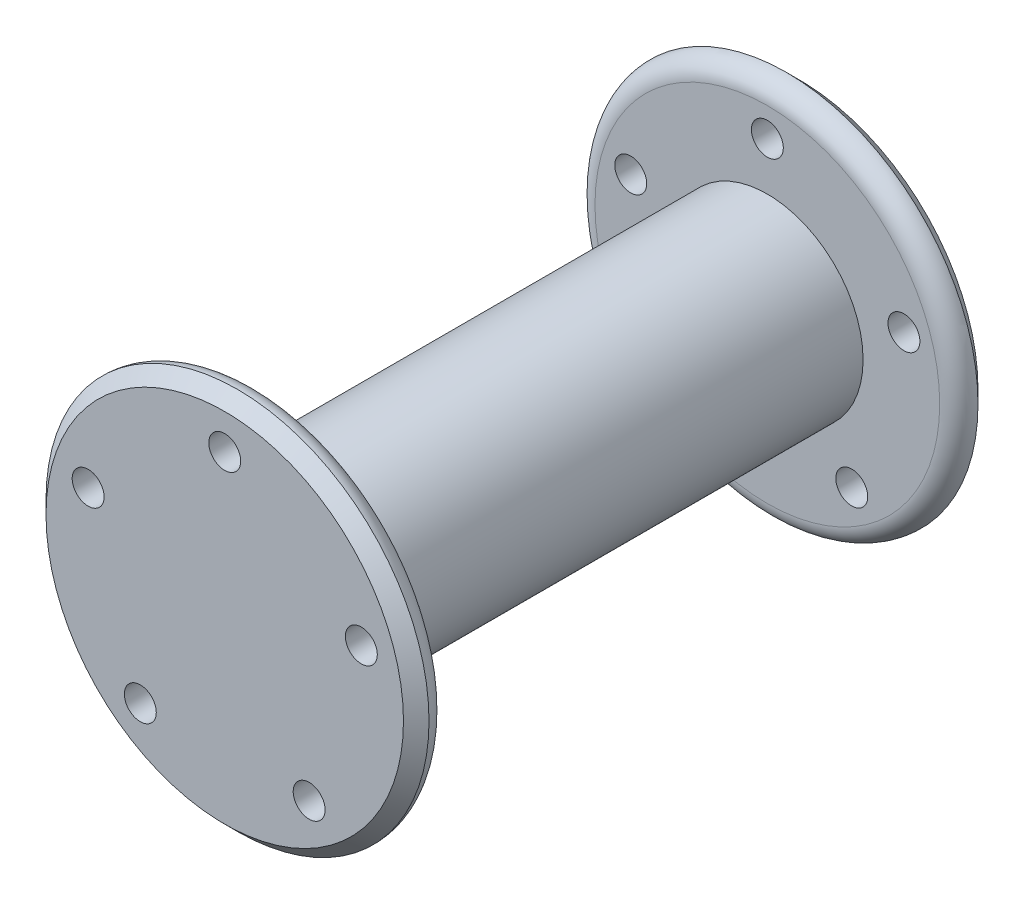
ISO-10303-21;
HEADER;
FILE_DESCRIPTION(('STEP AP214'),'2;1');
FILE_NAME('part.step','',(''),(''),'','','');
FILE_SCHEMA(('AUTOMOTIVE_DESIGN { 1 0 10303 214 1 1 1 1 }'));
ENDSEC;
DATA;
#1=APPLICATION_CONTEXT('core data for automotive mechanical design processes');
#2=APPLICATION_PROTOCOL_DEFINITION('international standard','automotive_design',2000,#1);
#3=PRODUCT_CONTEXT('',#1,'mechanical');
#4=PRODUCT('Part','Part','',(#3));
#5=PRODUCT_RELATED_PRODUCT_CATEGORY('part','',(#4));
#6=PRODUCT_DEFINITION_FORMATION('','',#4);
#7=PRODUCT_DEFINITION_CONTEXT('part definition',#1,'design');
#8=PRODUCT_DEFINITION('design','',#6,#7);
#9=PRODUCT_DEFINITION_SHAPE('','',#8);
#10=(LENGTH_UNIT() NAMED_UNIT(*) SI_UNIT(.MILLI.,.METRE.));
#11=(NAMED_UNIT(*) PLANE_ANGLE_UNIT() SI_UNIT($,.RADIAN.));
#12=(NAMED_UNIT(*) SI_UNIT($,.STERADIAN.) SOLID_ANGLE_UNIT());
#13=UNCERTAINTY_MEASURE_WITH_UNIT(LENGTH_MEASURE(1.E-05),#10,'distance_accuracy_value','');
#14=(GEOMETRIC_REPRESENTATION_CONTEXT(3) GLOBAL_UNCERTAINTY_ASSIGNED_CONTEXT((#13)) GLOBAL_UNIT_ASSIGNED_CONTEXT((#10,
#11,#12)) REPRESENTATION_CONTEXT('',''));
#15=CARTESIAN_POINT('',(0.,0.,0.));
#16=DIRECTION('',(0.,0.,1.));
#17=DIRECTION('',(1.,0.,0.));
#18=AXIS2_PLACEMENT_3D('',#15,#16,#17);
#19=CARTESIAN_POINT('',(0.,0.,40.));
#20=DIRECTION('',(0.,0.,-1.));
#21=DIRECTION('',(-1.,0.,0.));
#22=AXIS2_PLACEMENT_3D('',#19,#20,#21);
#23=CYLINDRICAL_SURFACE('',#22,15.);
#24=CARTESIAN_POINT('',(0.,0.,40.));
#25=DIRECTION('',(0.,0.,1.));
#26=DIRECTION('',(1.,0.,0.));
#27=AXIS2_PLACEMENT_3D('',#24,#25,#26);
#28=CIRCLE('',#27,15.);
#29=CARTESIAN_POINT('',(15.,0.,40.));
#30=VERTEX_POINT('',#29);
#31=EDGE_CURVE('E113',#30,#30,#28,.T.);
#32=ORIENTED_EDGE('',*,*,#31,.F.);
#33=EDGE_LOOP('',(#32));
#34=FACE_BOUND('',#33,.T.);
#35=CARTESIAN_POINT('',(0.,0.,-40.));
#36=DIRECTION('',(0.,0.,1.));
#37=DIRECTION('',(1.,0.,0.));
#38=AXIS2_PLACEMENT_3D('',#35,#36,#37);
#39=CIRCLE('',#38,15.);
#40=CARTESIAN_POINT('',(15.,0.,-40.));
#41=VERTEX_POINT('',#40);
#42=EDGE_CURVE('E118',#41,#41,#39,.T.);
#43=ORIENTED_EDGE('',*,*,#42,.T.);
#44=EDGE_LOOP('',(#43));
#45=FACE_BOUND('',#44,.T.);
#46=ADVANCED_FACE('F36',(#34,#45),#23,.T.);
#47=CARTESIAN_POINT('',(0.,0.,-45.));
#48=DIRECTION('',(0.,0.,-1.));
#49=DIRECTION('',(-1.,0.,0.));
#50=AXIS2_PLACEMENT_3D('',#47,#48,#49);
#51=PLANE('',#50);
#52=CARTESIAN_POINT('',(-21.398771616641,6.95288237343626,-45.));
#53=DIRECTION('',(0.,0.,-1.));
#54=DIRECTION('',(-0.309016994374945,-0.951056516295155,0.));
#55=AXIS2_PLACEMENT_3D('',#52,#53,#54);
#56=CIRCLE('',#55,2.5);
#57=CARTESIAN_POINT('',(-22.1713141025783,4.57524108269837,-45.));
#58=VERTEX_POINT('',#57);
#59=EDGE_CURVE('E91',#58,#58,#56,.T.);
#60=ORIENTED_EDGE('',*,*,#59,.F.);
#61=EDGE_LOOP('',(#60));
#62=FACE_BOUND('',#61,.T.);
#63=CARTESIAN_POINT('',(-13.2251681765805,-18.2028823734364,-45.));
#64=DIRECTION('',(0.,0.,-1.));
#65=DIRECTION('',(0.809016994374951,-0.587785252292469,0.));
#66=AXIS2_PLACEMENT_3D('',#63,#64,#65);
#67=CIRCLE('',#66,2.5);
#68=CARTESIAN_POINT('',(-11.2026256906432,-19.6723455041676,-45.));
#69=VERTEX_POINT('',#68);
#70=EDGE_CURVE('E96',#69,#69,#67,.T.);
#71=ORIENTED_EDGE('',*,*,#70,.F.);
#72=EDGE_LOOP('',(#71));
#73=FACE_BOUND('',#72,.T.);
#74=CARTESIAN_POINT('',(13.2251681765808,-18.2028823734362,-45.));
#75=DIRECTION('',(0.,0.,-1.));
#76=DIRECTION('',(0.809016994374942,0.58778525229248,0.));
#77=AXIS2_PLACEMENT_3D('',#74,#75,#76);
#78=CIRCLE('',#77,2.5);
#79=CARTESIAN_POINT('',(15.2477106625182,-16.733419242705,-45.));
#80=VERTEX_POINT('',#79);
#81=EDGE_CURVE('E100',#80,#80,#78,.T.);
#82=ORIENTED_EDGE('',*,*,#81,.F.);
#83=EDGE_LOOP('',(#82));
#84=FACE_BOUND('',#83,.T.);
#85=CARTESIAN_POINT('',(21.3987716166409,6.95288237343656,-45.));
#86=DIRECTION('',(0.,0.,-1.));
#87=DIRECTION('',(-0.309016994374958,0.95105651629515,0.));
#88=AXIS2_PLACEMENT_3D('',#85,#86,#87);
#89=CIRCLE('',#88,2.5);
#90=CARTESIAN_POINT('',(20.6262291307035,9.33052366417444,-45.));
#91=VERTEX_POINT('',#90);
#92=EDGE_CURVE('E63',#91,#91,#89,.T.);
#93=ORIENTED_EDGE('',*,*,#92,.F.);
#94=EDGE_LOOP('',(#93));
#95=FACE_BOUND('',#94,.T.);
#96=CARTESIAN_POINT('',(0.,22.5,-45.));
#97=DIRECTION('',(0.,0.,-1.));
#98=DIRECTION('',(-1.,0.,0.));
#99=AXIS2_PLACEMENT_3D('',#96,#97,#98);
#100=CIRCLE('',#99,2.5);
#101=CARTESIAN_POINT('',(-2.5,22.5,-45.));
#102=VERTEX_POINT('',#101);
#103=EDGE_CURVE('E107',#102,#102,#100,.T.);
#104=ORIENTED_EDGE('',*,*,#103,.F.);
#105=EDGE_LOOP('',(#104));
#106=FACE_BOUND('',#105,.T.);
#107=CARTESIAN_POINT('',(0.,0.,-45.));
#108=DIRECTION('',(0.,0.,-1.));
#109=DIRECTION('',(-1.,0.,0.));
#110=AXIS2_PLACEMENT_3D('',#107,#108,#109);
#111=CIRCLE('',#110,28.);
#112=CARTESIAN_POINT('',(-28.,0.,-45.));
#113=VERTEX_POINT('',#112);
#114=EDGE_CURVE('E117',#113,#113,#111,.T.);
#115=ORIENTED_EDGE('',*,*,#114,.T.);
#116=EDGE_LOOP('',(#115));
#117=FACE_BOUND('',#116,.T.);
#118=ADVANCED_FACE('F167',(#62,#73,#84,#95,#106,#117),#51,.T.);
#119=CARTESIAN_POINT('',(0.,0.,-40.));
#120=DIRECTION('',(0.,0.,-1.));
#121=DIRECTION('',(-1.,0.,0.));
#122=AXIS2_PLACEMENT_3D('',#119,#120,#121);
#123=PLANE('',#122);
#124=CARTESIAN_POINT('',(0.,0.,-40.));
#125=DIRECTION('',(0.,0.,-1.));
#126=DIRECTION('',(-1.,0.,0.));
#127=AXIS2_PLACEMENT_3D('',#124,#125,#126);
#128=CIRCLE('',#127,27.);
#129=CARTESIAN_POINT('',(-27.,0.,-40.));
#130=VERTEX_POINT('',#129);
#131=EDGE_CURVE('E55',#130,#130,#128,.F.);
#132=ORIENTED_EDGE('',*,*,#131,.T.);
#133=EDGE_LOOP('',(#132));
#134=FACE_BOUND('',#133,.T.);
#135=CARTESIAN_POINT('',(-21.398771616641,6.95288237343626,-40.));
#136=DIRECTION('',(0.,0.,-1.));
#137=DIRECTION('',(-1.,0.,0.));
#138=AXIS2_PLACEMENT_3D('',#135,#136,#137);
#139=CIRCLE('',#138,2.5);
#140=CARTESIAN_POINT('',(-23.898771616641,6.95288237343626,-40.));
#141=VERTEX_POINT('',#140);
#142=EDGE_CURVE('E112',#141,#141,#139,.T.);
#143=ORIENTED_EDGE('',*,*,#142,.T.);
#144=EDGE_LOOP('',(#143));
#145=FACE_BOUND('',#144,.T.);
#146=CARTESIAN_POINT('',(-13.2251681765805,-18.2028823734364,-40.));
#147=DIRECTION('',(0.,0.,-1.));
#148=DIRECTION('',(-1.,0.,0.));
#149=AXIS2_PLACEMENT_3D('',#146,#147,#148);
#150=CIRCLE('',#149,2.5);
#151=CARTESIAN_POINT('',(-15.7251681765805,-18.2028823734364,-40.));
#152=VERTEX_POINT('',#151);
#153=EDGE_CURVE('E139',#152,#152,#150,.T.);
#154=ORIENTED_EDGE('',*,*,#153,.T.);
#155=EDGE_LOOP('',(#154));
#156=FACE_BOUND('',#155,.T.);
#157=CARTESIAN_POINT('',(13.2251681765808,-18.2028823734362,-40.));
#158=DIRECTION('',(0.,0.,-1.));
#159=DIRECTION('',(-1.,0.,0.));
#160=AXIS2_PLACEMENT_3D('',#157,#158,#159);
#161=CIRCLE('',#160,2.5);
#162=CARTESIAN_POINT('',(10.7251681765808,-18.2028823734362,-40.));
#163=VERTEX_POINT('',#162);
#164=EDGE_CURVE('E135',#163,#163,#161,.T.);
#165=ORIENTED_EDGE('',*,*,#164,.T.);
#166=EDGE_LOOP('',(#165));
#167=FACE_BOUND('',#166,.T.);
#168=CARTESIAN_POINT('',(21.3987716166409,6.95288237343656,-40.));
#169=DIRECTION('',(0.,0.,-1.));
#170=DIRECTION('',(-1.,0.,0.));
#171=AXIS2_PLACEMENT_3D('',#168,#169,#170);
#172=CIRCLE('',#171,2.5);
#173=CARTESIAN_POINT('',(18.8987716166409,6.95288237343656,-40.));
#174=VERTEX_POINT('',#173);
#175=EDGE_CURVE('E95',#174,#174,#172,.T.);
#176=ORIENTED_EDGE('',*,*,#175,.T.);
#177=EDGE_LOOP('',(#176));
#178=FACE_BOUND('',#177,.T.);
#179=CARTESIAN_POINT('',(0.,22.5,-40.));
#180=DIRECTION('',(0.,0.,-1.));
#181=DIRECTION('',(-1.,0.,0.));
#182=AXIS2_PLACEMENT_3D('',#179,#180,#181);
#183=CIRCLE('',#182,2.5);
#184=CARTESIAN_POINT('',(-2.5,22.5,-40.));
#185=VERTEX_POINT('',#184);
#186=EDGE_CURVE('E111',#185,#185,#183,.T.);
#187=ORIENTED_EDGE('',*,*,#186,.T.);
#188=EDGE_LOOP('',(#187));
#189=FACE_BOUND('',#188,.T.);
#190=ORIENTED_EDGE('',*,*,#42,.F.);
#191=EDGE_LOOP('',(#190));
#192=FACE_BOUND('',#191,.T.);
#193=ADVANCED_FACE('F149',(#134,#145,#156,#167,#178,#189,#192),#123,.F.);
#194=CARTESIAN_POINT('',(0.,0.,-45.));
#195=DIRECTION('',(0.,0.,1.));
#196=DIRECTION('',(1.,0.,0.));
#197=AXIS2_PLACEMENT_3D('',#194,#195,#196);
#198=CONICAL_SURFACE('',#197,28.,0.785398163397447);
#199=CARTESIAN_POINT('',(0.,0.,-43.));
#200=DIRECTION('',(0.,0.,-1.));
#201=DIRECTION('',(-1.,0.,0.));
#202=AXIS2_PLACEMENT_3D('',#199,#200,#201);
#203=CIRCLE('',#202,30.);
#204=CARTESIAN_POINT('',(-30.,0.,-43.));
#205=VERTEX_POINT('',#204);
#206=EDGE_CURVE('E125',#205,#205,#203,.F.);
#207=ORIENTED_EDGE('',*,*,#206,.F.);
#208=EDGE_LOOP('',(#207));
#209=FACE_BOUND('',#208,.T.);
#210=ORIENTED_EDGE('',*,*,#114,.F.);
#211=EDGE_LOOP('',(#210));
#212=FACE_BOUND('',#211,.T.);
#213=ADVANCED_FACE('F160',(#209,#212),#198,.T.);
#214=CARTESIAN_POINT('',(0.,22.5,40.));
#215=DIRECTION('',(0.,0.,-1.));
#216=DIRECTION('',(-1.,0.,0.));
#217=AXIS2_PLACEMENT_3D('',#214,#215,#216);
#218=CYLINDRICAL_SURFACE('',#217,2.5);
#219=ORIENTED_EDGE('',*,*,#103,.T.);
#220=EDGE_LOOP('',(#219));
#221=FACE_BOUND('',#220,.T.);
#222=ORIENTED_EDGE('',*,*,#186,.F.);
#223=EDGE_LOOP('',(#222));
#224=FACE_BOUND('',#223,.T.);
#225=ADVANCED_FACE('F163',(#221,#224),#218,.F.);
#226=CARTESIAN_POINT('',(21.3987716166409,6.95288237343656,40.));
#227=DIRECTION('',(0.,0.,-1.));
#228=DIRECTION('',(-1.,0.,0.));
#229=AXIS2_PLACEMENT_3D('',#226,#227,#228);
#230=CYLINDRICAL_SURFACE('',#229,2.5);
#231=ORIENTED_EDGE('',*,*,#92,.T.);
#232=EDGE_LOOP('',(#231));
#233=FACE_BOUND('',#232,.T.);
#234=ORIENTED_EDGE('',*,*,#175,.F.);
#235=EDGE_LOOP('',(#234));
#236=FACE_BOUND('',#235,.T.);
#237=ADVANCED_FACE('F233',(#233,#236),#230,.F.);
#238=CARTESIAN_POINT('',(13.2251681765808,-18.2028823734362,40.));
#239=DIRECTION('',(0.,0.,-1.));
#240=DIRECTION('',(-1.,0.,0.));
#241=AXIS2_PLACEMENT_3D('',#238,#239,#240);
#242=CYLINDRICAL_SURFACE('',#241,2.5);
#243=ORIENTED_EDGE('',*,*,#81,.T.);
#244=EDGE_LOOP('',(#243));
#245=FACE_BOUND('',#244,.T.);
#246=ORIENTED_EDGE('',*,*,#164,.F.);
#247=EDGE_LOOP('',(#246));
#248=FACE_BOUND('',#247,.T.);
#249=ADVANCED_FACE('F230',(#245,#248),#242,.F.);
#250=CARTESIAN_POINT('',(-13.2251681765805,-18.2028823734364,40.));
#251=DIRECTION('',(0.,0.,-1.));
#252=DIRECTION('',(-1.,0.,0.));
#253=AXIS2_PLACEMENT_3D('',#250,#251,#252);
#254=CYLINDRICAL_SURFACE('',#253,2.5);
#255=ORIENTED_EDGE('',*,*,#70,.T.);
#256=EDGE_LOOP('',(#255));
#257=FACE_BOUND('',#256,.T.);
#258=ORIENTED_EDGE('',*,*,#153,.F.);
#259=EDGE_LOOP('',(#258));
#260=FACE_BOUND('',#259,.T.);
#261=ADVANCED_FACE('F226',(#257,#260),#254,.F.);
#262=CARTESIAN_POINT('',(-21.398771616641,6.95288237343626,40.));
#263=DIRECTION('',(0.,0.,-1.));
#264=DIRECTION('',(-1.,0.,0.));
#265=AXIS2_PLACEMENT_3D('',#262,#263,#264);
#266=CYLINDRICAL_SURFACE('',#265,2.5);
#267=ORIENTED_EDGE('',*,*,#59,.T.);
#268=EDGE_LOOP('',(#267));
#269=FACE_BOUND('',#268,.T.);
#270=ORIENTED_EDGE('',*,*,#142,.F.);
#271=EDGE_LOOP('',(#270));
#272=FACE_BOUND('',#271,.T.);
#273=ADVANCED_FACE('F156',(#269,#272),#266,.F.);
#274=CARTESIAN_POINT('',(0.,0.,-43.));
#275=DIRECTION('',(0.,0.,-1.));
#276=DIRECTION('',(-1.,0.,0.));
#277=AXIS2_PLACEMENT_3D('',#274,#275,#276);
#278=TOROIDAL_SURFACE('',#277,27.,3.);
#279=ORIENTED_EDGE('',*,*,#131,.F.);
#280=EDGE_LOOP('',(#279));
#281=FACE_BOUND('',#280,.T.);
#282=ORIENTED_EDGE('',*,*,#206,.T.);
#283=EDGE_LOOP('',(#282));
#284=FACE_BOUND('',#283,.T.);
#285=ADVANCED_FACE('F152',(#281,#284),#278,.T.);
#286=CARTESIAN_POINT('',(0.,0.,45.));
#287=DIRECTION('',(0.,0.,1.));
#288=DIRECTION('',(-1.,0.,0.));
#289=AXIS2_PLACEMENT_3D('',#286,#287,#288);
#290=PLANE('',#289);
#291=CARTESIAN_POINT('',(-21.398771616641,6.95288237343626,45.));
#292=DIRECTION('',(0.,0.,-1.));
#293=DIRECTION('',(-0.309016994374945,-0.951056516295155,0.));
#294=AXIS2_PLACEMENT_3D('',#291,#292,#293);
#295=CIRCLE('',#294,2.5);
#296=CARTESIAN_POINT('',(-18.898771616641,6.95288237343626,45.));
#297=VERTEX_POINT('',#296);
#298=EDGE_CURVE('E70',#297,#297,#295,.T.);
#299=ORIENTED_EDGE('',*,*,#298,.T.);
#300=EDGE_LOOP('',(#299));
#301=FACE_BOUND('',#300,.T.);
#302=CARTESIAN_POINT('',(-13.2251681765805,-18.2028823734364,45.));
#303=DIRECTION('',(0.,0.,-1.));
#304=DIRECTION('',(0.809016994374951,-0.587785252292469,0.));
#305=AXIS2_PLACEMENT_3D('',#302,#303,#304);
#306=CIRCLE('',#305,2.5);
#307=CARTESIAN_POINT('',(-10.7251681765805,-18.2028823734364,45.));
#308=VERTEX_POINT('',#307);
#309=EDGE_CURVE('E374',#308,#308,#306,.T.);
#310=ORIENTED_EDGE('',*,*,#309,.T.);
#311=EDGE_LOOP('',(#310));
#312=FACE_BOUND('',#311,.T.);
#313=CARTESIAN_POINT('',(13.2251681765808,-18.2028823734362,45.));
#314=DIRECTION('',(0.,0.,-1.));
#315=DIRECTION('',(0.809016994374942,0.58778525229248,0.));
#316=AXIS2_PLACEMENT_3D('',#313,#314,#315);
#317=CIRCLE('',#316,2.5);
#318=CARTESIAN_POINT('',(15.7251681765808,-18.2028823734362,45.));
#319=VERTEX_POINT('',#318);
#320=EDGE_CURVE('E378',#319,#319,#317,.T.);
#321=ORIENTED_EDGE('',*,*,#320,.T.);
#322=EDGE_LOOP('',(#321));
#323=FACE_BOUND('',#322,.T.);
#324=CARTESIAN_POINT('',(21.3987716166409,6.95288237343656,45.));
#325=DIRECTION('',(0.,0.,-1.));
#326=DIRECTION('',(-0.309016994374958,0.95105651629515,0.));
#327=AXIS2_PLACEMENT_3D('',#324,#325,#326);
#328=CIRCLE('',#327,2.5);
#329=CARTESIAN_POINT('',(23.8987716166409,6.95288237343656,45.));
#330=VERTEX_POINT('',#329);
#331=EDGE_CURVE('E89',#330,#330,#328,.T.);
#332=ORIENTED_EDGE('',*,*,#331,.T.);
#333=EDGE_LOOP('',(#332));
#334=FACE_BOUND('',#333,.T.);
#335=CARTESIAN_POINT('',(0.,22.5,45.));
#336=DIRECTION('',(0.,0.,-1.));
#337=DIRECTION('',(-1.,0.,0.));
#338=AXIS2_PLACEMENT_3D('',#335,#336,#337);
#339=CIRCLE('',#338,2.5);
#340=CARTESIAN_POINT('',(2.5,22.5,45.));
#341=VERTEX_POINT('',#340);
#342=EDGE_CURVE('E64',#341,#341,#339,.T.);
#343=ORIENTED_EDGE('',*,*,#342,.T.);
#344=EDGE_LOOP('',(#343));
#345=FACE_BOUND('',#344,.T.);
#346=CARTESIAN_POINT('',(0.,0.,45.));
#347=DIRECTION('',(0.,0.,1.));
#348=DIRECTION('',(1.,0.,0.));
#349=AXIS2_PLACEMENT_3D('',#346,#347,#348);
#350=CIRCLE('',#349,28.);
#351=CARTESIAN_POINT('',(28.,0.,45.));
#352=VERTEX_POINT('',#351);
#353=EDGE_CURVE('E44',#352,#352,#350,.T.);
#354=ORIENTED_EDGE('',*,*,#353,.T.);
#355=EDGE_LOOP('',(#354));
#356=FACE_BOUND('',#355,.T.);
#357=ADVANCED_FACE('F155',(#301,#312,#323,#334,#345,#356),#290,.T.);
#358=CARTESIAN_POINT('',(0.,0.,40.));
#359=DIRECTION('',(0.,0.,1.));
#360=DIRECTION('',(-1.,0.,0.));
#361=AXIS2_PLACEMENT_3D('',#358,#359,#360);
#362=PLANE('',#361);
#363=CARTESIAN_POINT('',(0.,0.,40.));
#364=DIRECTION('',(0.,0.,1.));
#365=DIRECTION('',(1.,0.,0.));
#366=AXIS2_PLACEMENT_3D('',#363,#364,#365);
#367=CIRCLE('',#366,27.);
#368=CARTESIAN_POINT('',(27.,0.,40.));
#369=VERTEX_POINT('',#368);
#370=EDGE_CURVE('E10',#369,#369,#367,.F.);
#371=ORIENTED_EDGE('',*,*,#370,.T.);
#372=EDGE_LOOP('',(#371));
#373=FACE_BOUND('',#372,.T.);
#374=CARTESIAN_POINT('',(-21.398771616641,6.95288237343626,40.));
#375=DIRECTION('',(0.,0.,1.));
#376=DIRECTION('',(1.,0.,0.));
#377=AXIS2_PLACEMENT_3D('',#374,#375,#376);
#378=CIRCLE('',#377,2.5);
#379=CARTESIAN_POINT('',(-18.898771616641,6.95288237343626,40.));
#380=VERTEX_POINT('',#379);
#381=EDGE_CURVE('E77',#380,#380,#378,.F.);
#382=ORIENTED_EDGE('',*,*,#381,.F.);
#383=EDGE_LOOP('',(#382));
#384=FACE_BOUND('',#383,.T.);
#385=CARTESIAN_POINT('',(-13.2251681765805,-18.2028823734364,40.));
#386=DIRECTION('',(0.,0.,1.));
#387=DIRECTION('',(1.,0.,0.));
#388=AXIS2_PLACEMENT_3D('',#385,#386,#387);
#389=CIRCLE('',#388,2.5);
#390=CARTESIAN_POINT('',(-10.7251681765805,-18.2028823734364,40.));
#391=VERTEX_POINT('',#390);
#392=EDGE_CURVE('E74',#391,#391,#389,.F.);
#393=ORIENTED_EDGE('',*,*,#392,.F.);
#394=EDGE_LOOP('',(#393));
#395=FACE_BOUND('',#394,.T.);
#396=CARTESIAN_POINT('',(13.2251681765808,-18.2028823734362,40.));
#397=DIRECTION('',(0.,0.,1.));
#398=DIRECTION('',(1.,0.,0.));
#399=AXIS2_PLACEMENT_3D('',#396,#397,#398);
#400=CIRCLE('',#399,2.5);
#401=CARTESIAN_POINT('',(15.7251681765808,-18.2028823734362,40.));
#402=VERTEX_POINT('',#401);
#403=EDGE_CURVE('E69',#402,#402,#400,.F.);
#404=ORIENTED_EDGE('',*,*,#403,.F.);
#405=EDGE_LOOP('',(#404));
#406=FACE_BOUND('',#405,.T.);
#407=CARTESIAN_POINT('',(21.3987716166409,6.95288237343656,40.));
#408=DIRECTION('',(0.,0.,1.));
#409=DIRECTION('',(1.,0.,0.));
#410=AXIS2_PLACEMENT_3D('',#407,#408,#409);
#411=CIRCLE('',#410,2.5);
#412=CARTESIAN_POINT('',(23.8987716166409,6.95288237343656,40.));
#413=VERTEX_POINT('',#412);
#414=EDGE_CURVE('E65',#413,#413,#411,.F.);
#415=ORIENTED_EDGE('',*,*,#414,.F.);
#416=EDGE_LOOP('',(#415));
#417=FACE_BOUND('',#416,.T.);
#418=CARTESIAN_POINT('',(0.,22.5,40.));
#419=DIRECTION('',(0.,0.,1.));
#420=DIRECTION('',(1.,0.,0.));
#421=AXIS2_PLACEMENT_3D('',#418,#419,#420);
#422=CIRCLE('',#421,2.5);
#423=CARTESIAN_POINT('',(2.5,22.5,40.));
#424=VERTEX_POINT('',#423);
#425=EDGE_CURVE('E59',#424,#424,#422,.F.);
#426=ORIENTED_EDGE('',*,*,#425,.F.);
#427=EDGE_LOOP('',(#426));
#428=FACE_BOUND('',#427,.T.);
#429=ORIENTED_EDGE('',*,*,#31,.T.);
#430=EDGE_LOOP('',(#429));
#431=FACE_BOUND('',#430,.T.);
#432=ADVANCED_FACE('F185',(#373,#384,#395,#406,#417,#428,#431),#362,.F.);
#433=CARTESIAN_POINT('',(0.,0.,43.));
#434=DIRECTION('',(0.,0.,-1.));
#435=DIRECTION('',(-1.,0.,0.));
#436=AXIS2_PLACEMENT_3D('',#433,#434,#435);
#437=CONICAL_SURFACE('',#436,30.,0.785398163397443);
#438=ORIENTED_EDGE('',*,*,#353,.F.);
#439=EDGE_LOOP('',(#438));
#440=FACE_BOUND('',#439,.T.);
#441=CARTESIAN_POINT('',(0.,0.,43.));
#442=DIRECTION('',(0.,0.,1.));
#443=DIRECTION('',(1.,0.,0.));
#444=AXIS2_PLACEMENT_3D('',#441,#442,#443);
#445=CIRCLE('',#444,30.);
#446=CARTESIAN_POINT('',(30.,0.,43.));
#447=VERTEX_POINT('',#446);
#448=EDGE_CURVE('E49',#447,#447,#445,.F.);
#449=ORIENTED_EDGE('',*,*,#448,.F.);
#450=EDGE_LOOP('',(#449));
#451=FACE_BOUND('',#450,.T.);
#452=ADVANCED_FACE('F182',(#440,#451),#437,.T.);
#453=CARTESIAN_POINT('',(0.,22.5,-45.));
#454=DIRECTION('',(0.,0.,1.));
#455=DIRECTION('',(1.,0.,0.));
#456=AXIS2_PLACEMENT_3D('',#453,#454,#455);
#457=CYLINDRICAL_SURFACE('',#456,2.5);
#458=CARTESIAN_POINT('',(2.5,22.5,45.));
#459=CARTESIAN_POINT('',(2.5,22.5,44.9479166666667));
#460=CARTESIAN_POINT('',(2.5,22.5,44.8958333333333));
#461=CARTESIAN_POINT('',(2.5,22.5,44.7916666666667));
#462=CARTESIAN_POINT('',(2.5,22.5,44.7395833333333));
#463=CARTESIAN_POINT('',(2.5,22.5,44.6354166666667));
#464=CARTESIAN_POINT('',(2.5,22.5,44.5833333333333));
#465=CARTESIAN_POINT('',(2.5,22.5,44.4791666666667));
#466=CARTESIAN_POINT('',(2.5,22.5,44.4270833333333));
#467=CARTESIAN_POINT('',(2.5,22.5,44.3229166666667));
#468=CARTESIAN_POINT('',(2.5,22.5,44.2708333333333));
#469=CARTESIAN_POINT('',(2.5,22.5,44.1666666666667));
#470=CARTESIAN_POINT('',(2.5,22.5,44.1145833333333));
#471=CARTESIAN_POINT('',(2.5,22.5,44.0104166666667));
#472=CARTESIAN_POINT('',(2.5,22.5,43.9583333333333));
#473=CARTESIAN_POINT('',(2.5,22.5,43.8541666666667));
#474=CARTESIAN_POINT('',(2.5,22.5,43.8020833333333));
#475=CARTESIAN_POINT('',(2.5,22.5,43.6979166666667));
#476=CARTESIAN_POINT('',(2.5,22.5,43.6458333333333));
#477=CARTESIAN_POINT('',(2.5,22.5,43.5416666666667));
#478=CARTESIAN_POINT('',(2.5,22.5,43.4895833333333));
#479=CARTESIAN_POINT('',(2.5,22.5,43.3854166666667));
#480=CARTESIAN_POINT('',(2.5,22.5,43.3333333333333));
#481=CARTESIAN_POINT('',(2.5,22.5,43.2291666666667));
#482=CARTESIAN_POINT('',(2.5,22.5,43.1770833333333));
#483=CARTESIAN_POINT('',(2.5,22.5,43.0729166666667));
#484=CARTESIAN_POINT('',(2.5,22.5,43.0208333333333));
#485=CARTESIAN_POINT('',(2.5,22.5,42.9166666666667));
#486=CARTESIAN_POINT('',(2.5,22.5,42.8645833333333));
#487=CARTESIAN_POINT('',(2.5,22.5,42.7604166666667));
#488=CARTESIAN_POINT('',(2.5,22.5,42.7083333333333));
#489=CARTESIAN_POINT('',(2.5,22.5,42.6041666666667));
#490=CARTESIAN_POINT('',(2.5,22.5,42.5520833333333));
#491=CARTESIAN_POINT('',(2.5,22.5,42.4479166666667));
#492=CARTESIAN_POINT('',(2.5,22.5,42.3958333333333));
#493=CARTESIAN_POINT('',(2.5,22.5,42.2916666666667));
#494=CARTESIAN_POINT('',(2.5,22.5,42.2395833333333));
#495=CARTESIAN_POINT('',(2.5,22.5,42.1354166666667));
#496=CARTESIAN_POINT('',(2.5,22.5,42.0833333333333));
#497=CARTESIAN_POINT('',(2.5,22.5,41.9791666666667));
#498=CARTESIAN_POINT('',(2.5,22.5,41.9270833333333));
#499=CARTESIAN_POINT('',(2.5,22.5,41.8229166666667));
#500=CARTESIAN_POINT('',(2.5,22.5,41.7708333333333));
#501=CARTESIAN_POINT('',(2.5,22.5,41.6666666666667));
#502=CARTESIAN_POINT('',(2.5,22.5,41.6145833333333));
#503=CARTESIAN_POINT('',(2.5,22.5,41.5104166666667));
#504=CARTESIAN_POINT('',(2.5,22.5,41.4583333333333));
#505=CARTESIAN_POINT('',(2.5,22.5,41.3541666666667));
#506=CARTESIAN_POINT('',(2.5,22.5,41.3020833333333));
#507=CARTESIAN_POINT('',(2.5,22.5,41.1979166666667));
#508=CARTESIAN_POINT('',(2.5,22.5,41.1458333333333));
#509=CARTESIAN_POINT('',(2.5,22.5,41.0416666666667));
#510=CARTESIAN_POINT('',(2.5,22.5,40.9895833333333));
#511=CARTESIAN_POINT('',(2.5,22.5,40.8854166666667));
#512=CARTESIAN_POINT('',(2.5,22.5,40.8333333333333));
#513=CARTESIAN_POINT('',(2.5,22.5,40.7291666666667));
#514=CARTESIAN_POINT('',(2.5,22.5,40.6770833333333));
#515=CARTESIAN_POINT('',(2.5,22.5,40.5729166666666));
#516=CARTESIAN_POINT('',(2.5,22.5,40.5208333333333));
#517=CARTESIAN_POINT('',(2.5,22.5,40.4166666666667));
#518=CARTESIAN_POINT('',(2.5,22.5,40.3645833333333));
#519=CARTESIAN_POINT('',(2.5,22.5,40.2604166666667));
#520=CARTESIAN_POINT('',(2.5,22.5,40.2083333333333));
#521=CARTESIAN_POINT('',(2.5,22.5,40.1041666666666));
#522=CARTESIAN_POINT('',(2.5,22.5,40.0520833333333));
#523=CARTESIAN_POINT('',(2.5,22.5,40.));
#524=B_SPLINE_CURVE_WITH_KNOTS('',3,(#458,#459,#460,#461,#462,#463,#464,#465,#466,#467,#468,
#469,#470,#471,#472,#473,#474,#475,#476,#477,#478,#479,#480,#481,#482,#483,#484,#485,#486,#487,
#488,#489,#490,#491,#492,#493,#494,#495,#496,#497,#498,#499,#500,#501,#502,#503,#504,#505,#506,
#507,#508,#509,#510,#511,#512,#513,#514,#515,#516,#517,#518,#519,#520,#521,#522,#523),
.UNSPECIFIED.,.F.,.F.,(4,2,2,2,2,2,2,2,2,2,2,2,2,2,2,2,2,2,2,2,2,2,2,2,2,2,2,2,2,2,2,2,4),(0.,
0.156249999999997,0.312500000000007,0.468750000000004,0.625000000000001,0.781250000000011,
0.937500000000008,1.09375,1.25,1.40625000000001,1.56250000000001,1.71875,1.87500000000002,
2.03125000000001,2.18750000000001,2.34375000000002,2.50000000000002,2.65625000000001,
2.81250000000002,2.96875000000002,3.12500000000002,3.28125000000003,3.43750000000002,
3.59375000000002,3.75000000000003,3.90625000000003,4.06250000000002,4.21875000000002,
4.37500000000003,4.53125000000003,4.68750000000002,4.84375000000004,5.00000000000003),.UNSPECIFIED.);
#525=EDGE_CURVE('BSEAM184',#341,#424,#524,.T.);
#526=ORIENTED_EDGE('',*,*,#342,.F.);
#527=ORIENTED_EDGE('',*,*,#425,.T.);
#528=ORIENTED_EDGE('',*,*,#525,.T.);
#529=ORIENTED_EDGE('',*,*,#525,.F.);
#530=EDGE_LOOP('',(#526,#528,#527,#529));
#531=FACE_BOUND('',#530,.T.);
#532=ADVANCED_FACE('F184',(#531),#457,.F.);
#533=CARTESIAN_POINT('',(21.3987716166409,6.95288237343656,-45.));
#534=DIRECTION('',(0.,0.,1.));
#535=DIRECTION('',(1.,0.,0.));
#536=AXIS2_PLACEMENT_3D('',#533,#534,#535);
#537=CYLINDRICAL_SURFACE('',#536,2.5);
#538=CARTESIAN_POINT('',(23.8987716166409,6.95288237343656,45.));
#539=CARTESIAN_POINT('',(23.8987716166409,6.95288237343656,44.9479166666667));
#540=CARTESIAN_POINT('',(23.8987716166409,6.95288237343656,44.8958333333333));
#541=CARTESIAN_POINT('',(23.8987716166409,6.95288237343656,44.7916666666667));
#542=CARTESIAN_POINT('',(23.8987716166409,6.95288237343656,44.7395833333333));
#543=CARTESIAN_POINT('',(23.8987716166409,6.95288237343656,44.6354166666667));
#544=CARTESIAN_POINT('',(23.8987716166409,6.95288237343656,44.5833333333333));
#545=CARTESIAN_POINT('',(23.8987716166409,6.95288237343656,44.4791666666667));
#546=CARTESIAN_POINT('',(23.8987716166409,6.95288237343656,44.4270833333333));
#547=CARTESIAN_POINT('',(23.8987716166409,6.95288237343656,44.3229166666667));
#548=CARTESIAN_POINT('',(23.8987716166409,6.95288237343656,44.2708333333333));
#549=CARTESIAN_POINT('',(23.8987716166409,6.95288237343656,44.1666666666667));
#550=CARTESIAN_POINT('',(23.8987716166409,6.95288237343656,44.1145833333333));
#551=CARTESIAN_POINT('',(23.8987716166409,6.95288237343656,44.0104166666667));
#552=CARTESIAN_POINT('',(23.8987716166409,6.95288237343656,43.9583333333333));
#553=CARTESIAN_POINT('',(23.8987716166409,6.95288237343656,43.8541666666667));
#554=CARTESIAN_POINT('',(23.8987716166409,6.95288237343656,43.8020833333333));
#555=CARTESIAN_POINT('',(23.8987716166409,6.95288237343656,43.6979166666667));
#556=CARTESIAN_POINT('',(23.8987716166409,6.95288237343656,43.6458333333333));
#557=CARTESIAN_POINT('',(23.8987716166409,6.95288237343656,43.5416666666667));
#558=CARTESIAN_POINT('',(23.8987716166409,6.95288237343656,43.4895833333333));
#559=CARTESIAN_POINT('',(23.8987716166409,6.95288237343656,43.3854166666667));
#560=CARTESIAN_POINT('',(23.8987716166409,6.95288237343656,43.3333333333333));
#561=CARTESIAN_POINT('',(23.8987716166409,6.95288237343656,43.2291666666667));
#562=CARTESIAN_POINT('',(23.8987716166409,6.95288237343656,43.1770833333333));
#563=CARTESIAN_POINT('',(23.8987716166409,6.95288237343656,43.0729166666667));
#564=CARTESIAN_POINT('',(23.8987716166409,6.95288237343656,43.0208333333333));
#565=CARTESIAN_POINT('',(23.8987716166409,6.95288237343656,42.9166666666667));
#566=CARTESIAN_POINT('',(23.8987716166409,6.95288237343656,42.8645833333333));
#567=CARTESIAN_POINT('',(23.8987716166409,6.95288237343656,42.7604166666667));
#568=CARTESIAN_POINT('',(23.8987716166409,6.95288237343656,42.7083333333333));
#569=CARTESIAN_POINT('',(23.8987716166409,6.95288237343656,42.6041666666667));
#570=CARTESIAN_POINT('',(23.8987716166409,6.95288237343656,42.5520833333333));
#571=CARTESIAN_POINT('',(23.8987716166409,6.95288237343656,42.4479166666667));
#572=CARTESIAN_POINT('',(23.8987716166409,6.95288237343656,42.3958333333333));
#573=CARTESIAN_POINT('',(23.8987716166409,6.95288237343656,42.2916666666667));
#574=CARTESIAN_POINT('',(23.8987716166409,6.95288237343656,42.2395833333333));
#575=CARTESIAN_POINT('',(23.8987716166409,6.95288237343656,42.1354166666667));
#576=CARTESIAN_POINT('',(23.8987716166409,6.95288237343656,42.0833333333333));
#577=CARTESIAN_POINT('',(23.8987716166409,6.95288237343656,41.9791666666667));
#578=CARTESIAN_POINT('',(23.8987716166409,6.95288237343656,41.9270833333333));
#579=CARTESIAN_POINT('',(23.8987716166409,6.95288237343656,41.8229166666667));
#580=CARTESIAN_POINT('',(23.8987716166409,6.95288237343656,41.7708333333333));
#581=CARTESIAN_POINT('',(23.8987716166409,6.95288237343656,41.6666666666667));
#582=CARTESIAN_POINT('',(23.8987716166409,6.95288237343656,41.6145833333333));
#583=CARTESIAN_POINT('',(23.8987716166409,6.95288237343656,41.5104166666667));
#584=CARTESIAN_POINT('',(23.8987716166409,6.95288237343656,41.4583333333333));
#585=CARTESIAN_POINT('',(23.8987716166409,6.95288237343656,41.3541666666667));
#586=CARTESIAN_POINT('',(23.8987716166409,6.95288237343656,41.3020833333333));
#587=CARTESIAN_POINT('',(23.8987716166409,6.95288237343656,41.1979166666667));
#588=CARTESIAN_POINT('',(23.8987716166409,6.95288237343656,41.1458333333333));
#589=CARTESIAN_POINT('',(23.8987716166409,6.95288237343656,41.0416666666667));
#590=CARTESIAN_POINT('',(23.8987716166409,6.95288237343656,40.9895833333333));
#591=CARTESIAN_POINT('',(23.8987716166409,6.95288237343656,40.8854166666667));
#592=CARTESIAN_POINT('',(23.8987716166409,6.95288237343656,40.8333333333333));
#593=CARTESIAN_POINT('',(23.8987716166409,6.95288237343656,40.7291666666667));
#594=CARTESIAN_POINT('',(23.8987716166409,6.95288237343656,40.6770833333333));
#595=CARTESIAN_POINT('',(23.8987716166409,6.95288237343656,40.5729166666666));
#596=CARTESIAN_POINT('',(23.8987716166409,6.95288237343656,40.5208333333333));
#597=CARTESIAN_POINT('',(23.8987716166409,6.95288237343656,40.4166666666667));
#598=CARTESIAN_POINT('',(23.8987716166409,6.95288237343656,40.3645833333333));
#599=CARTESIAN_POINT('',(23.8987716166409,6.95288237343656,40.2604166666667));
#600=CARTESIAN_POINT('',(23.8987716166409,6.95288237343656,40.2083333333333));
#601=CARTESIAN_POINT('',(23.8987716166409,6.95288237343656,40.1041666666666));
#602=CARTESIAN_POINT('',(23.8987716166409,6.95288237343656,40.0520833333333));
#603=CARTESIAN_POINT('',(23.8987716166409,6.95288237343656,40.));
#604=B_SPLINE_CURVE_WITH_KNOTS('',3,(#538,#539,#540,#541,#542,#543,#544,#545,#546,#547,#548,
#549,#550,#551,#552,#553,#554,#555,#556,#557,#558,#559,#560,#561,#562,#563,#564,#565,#566,#567,
#568,#569,#570,#571,#572,#573,#574,#575,#576,#577,#578,#579,#580,#581,#582,#583,#584,#585,#586,
#587,#588,#589,#590,#591,#592,#593,#594,#595,#596,#597,#598,#599,#600,#601,#602,#603),
.UNSPECIFIED.,.F.,.F.,(4,2,2,2,2,2,2,2,2,2,2,2,2,2,2,2,2,2,2,2,2,2,2,2,2,2,2,2,2,2,2,2,4),(0.,
0.156249999999997,0.312500000000007,0.468750000000004,0.625000000000001,0.781250000000011,
0.937500000000008,1.09375,1.25,1.40625000000001,1.56250000000001,1.71875,1.87500000000002,
2.03125000000001,2.18750000000001,2.34375000000002,2.50000000000002,2.65625000000001,
2.81250000000002,2.96875000000002,3.12500000000002,3.28125000000003,3.43750000000002,
3.59375000000002,3.75000000000003,3.90625000000003,4.06250000000002,4.21875000000002,
4.37500000000003,4.53125000000003,4.68750000000002,4.84375000000004,5.00000000000003),.UNSPECIFIED.);
#605=EDGE_CURVE('BSEAM191',#330,#413,#604,.T.);
#606=ORIENTED_EDGE('',*,*,#331,.F.);
#607=ORIENTED_EDGE('',*,*,#414,.T.);
#608=ORIENTED_EDGE('',*,*,#605,.T.);
#609=ORIENTED_EDGE('',*,*,#605,.F.);
#610=EDGE_LOOP('',(#606,#608,#607,#609));
#611=FACE_BOUND('',#610,.T.);
#612=ADVANCED_FACE('F191',(#611),#537,.F.);
#613=CARTESIAN_POINT('',(13.2251681765808,-18.2028823734362,-45.));
#614=DIRECTION('',(0.,0.,1.));
#615=DIRECTION('',(1.,0.,0.));
#616=AXIS2_PLACEMENT_3D('',#613,#614,#615);
#617=CYLINDRICAL_SURFACE('',#616,2.5);
#618=CARTESIAN_POINT('',(15.7251681765808,-18.2028823734362,45.));
#619=CARTESIAN_POINT('',(15.7251681765808,-18.2028823734362,44.9479166666667));
#620=CARTESIAN_POINT('',(15.7251681765808,-18.2028823734362,44.8958333333333));
#621=CARTESIAN_POINT('',(15.7251681765808,-18.2028823734362,44.7916666666667));
#622=CARTESIAN_POINT('',(15.7251681765808,-18.2028823734362,44.7395833333333));
#623=CARTESIAN_POINT('',(15.7251681765808,-18.2028823734362,44.6354166666667));
#624=CARTESIAN_POINT('',(15.7251681765808,-18.2028823734362,44.5833333333333));
#625=CARTESIAN_POINT('',(15.7251681765808,-18.2028823734362,44.4791666666667));
#626=CARTESIAN_POINT('',(15.7251681765808,-18.2028823734362,44.4270833333333));
#627=CARTESIAN_POINT('',(15.7251681765808,-18.2028823734362,44.3229166666667));
#628=CARTESIAN_POINT('',(15.7251681765808,-18.2028823734362,44.2708333333333));
#629=CARTESIAN_POINT('',(15.7251681765808,-18.2028823734362,44.1666666666667));
#630=CARTESIAN_POINT('',(15.7251681765808,-18.2028823734362,44.1145833333333));
#631=CARTESIAN_POINT('',(15.7251681765808,-18.2028823734362,44.0104166666667));
#632=CARTESIAN_POINT('',(15.7251681765808,-18.2028823734362,43.9583333333333));
#633=CARTESIAN_POINT('',(15.7251681765808,-18.2028823734362,43.8541666666667));
#634=CARTESIAN_POINT('',(15.7251681765808,-18.2028823734362,43.8020833333333));
#635=CARTESIAN_POINT('',(15.7251681765808,-18.2028823734362,43.6979166666667));
#636=CARTESIAN_POINT('',(15.7251681765808,-18.2028823734362,43.6458333333333));
#637=CARTESIAN_POINT('',(15.7251681765808,-18.2028823734362,43.5416666666667));
#638=CARTESIAN_POINT('',(15.7251681765808,-18.2028823734362,43.4895833333333));
#639=CARTESIAN_POINT('',(15.7251681765808,-18.2028823734362,43.3854166666667));
#640=CARTESIAN_POINT('',(15.7251681765808,-18.2028823734362,43.3333333333333));
#641=CARTESIAN_POINT('',(15.7251681765808,-18.2028823734362,43.2291666666667));
#642=CARTESIAN_POINT('',(15.7251681765808,-18.2028823734362,43.1770833333333));
#643=CARTESIAN_POINT('',(15.7251681765808,-18.2028823734362,43.0729166666667));
#644=CARTESIAN_POINT('',(15.7251681765808,-18.2028823734362,43.0208333333333));
#645=CARTESIAN_POINT('',(15.7251681765808,-18.2028823734362,42.9166666666667));
#646=CARTESIAN_POINT('',(15.7251681765808,-18.2028823734362,42.8645833333333));
#647=CARTESIAN_POINT('',(15.7251681765808,-18.2028823734362,42.7604166666667));
#648=CARTESIAN_POINT('',(15.7251681765808,-18.2028823734362,42.7083333333333));
#649=CARTESIAN_POINT('',(15.7251681765808,-18.2028823734362,42.6041666666667));
#650=CARTESIAN_POINT('',(15.7251681765808,-18.2028823734362,42.5520833333333));
#651=CARTESIAN_POINT('',(15.7251681765808,-18.2028823734362,42.4479166666667));
#652=CARTESIAN_POINT('',(15.7251681765808,-18.2028823734362,42.3958333333333));
#653=CARTESIAN_POINT('',(15.7251681765808,-18.2028823734362,42.2916666666667));
#654=CARTESIAN_POINT('',(15.7251681765808,-18.2028823734362,42.2395833333333));
#655=CARTESIAN_POINT('',(15.7251681765808,-18.2028823734362,42.1354166666667));
#656=CARTESIAN_POINT('',(15.7251681765808,-18.2028823734362,42.0833333333333));
#657=CARTESIAN_POINT('',(15.7251681765808,-18.2028823734362,41.9791666666667));
#658=CARTESIAN_POINT('',(15.7251681765808,-18.2028823734362,41.9270833333333));
#659=CARTESIAN_POINT('',(15.7251681765808,-18.2028823734362,41.8229166666667));
#660=CARTESIAN_POINT('',(15.7251681765808,-18.2028823734362,41.7708333333333));
#661=CARTESIAN_POINT('',(15.7251681765808,-18.2028823734362,41.6666666666667));
#662=CARTESIAN_POINT('',(15.7251681765808,-18.2028823734362,41.6145833333333));
#663=CARTESIAN_POINT('',(15.7251681765808,-18.2028823734362,41.5104166666667));
#664=CARTESIAN_POINT('',(15.7251681765808,-18.2028823734362,41.4583333333333));
#665=CARTESIAN_POINT('',(15.7251681765808,-18.2028823734362,41.3541666666667));
#666=CARTESIAN_POINT('',(15.7251681765808,-18.2028823734362,41.3020833333333));
#667=CARTESIAN_POINT('',(15.7251681765808,-18.2028823734362,41.1979166666667));
#668=CARTESIAN_POINT('',(15.7251681765808,-18.2028823734362,41.1458333333333));
#669=CARTESIAN_POINT('',(15.7251681765808,-18.2028823734362,41.0416666666667));
#670=CARTESIAN_POINT('',(15.7251681765808,-18.2028823734362,40.9895833333333));
#671=CARTESIAN_POINT('',(15.7251681765808,-18.2028823734362,40.8854166666667));
#672=CARTESIAN_POINT('',(15.7251681765808,-18.2028823734362,40.8333333333333));
#673=CARTESIAN_POINT('',(15.7251681765808,-18.2028823734362,40.7291666666667));
#674=CARTESIAN_POINT('',(15.7251681765808,-18.2028823734362,40.6770833333333));
#675=CARTESIAN_POINT('',(15.7251681765808,-18.2028823734362,40.5729166666666));
#676=CARTESIAN_POINT('',(15.7251681765808,-18.2028823734362,40.5208333333333));
#677=CARTESIAN_POINT('',(15.7251681765808,-18.2028823734362,40.4166666666667));
#678=CARTESIAN_POINT('',(15.7251681765808,-18.2028823734362,40.3645833333333));
#679=CARTESIAN_POINT('',(15.7251681765808,-18.2028823734362,40.2604166666667));
#680=CARTESIAN_POINT('',(15.7251681765808,-18.2028823734362,40.2083333333333));
#681=CARTESIAN_POINT('',(15.7251681765808,-18.2028823734362,40.1041666666666));
#682=CARTESIAN_POINT('',(15.7251681765808,-18.2028823734362,40.0520833333333));
#683=CARTESIAN_POINT('',(15.7251681765808,-18.2028823734362,40.));
#684=B_SPLINE_CURVE_WITH_KNOTS('',3,(#618,#619,#620,#621,#622,#623,#624,#625,#626,#627,#628,
#629,#630,#631,#632,#633,#634,#635,#636,#637,#638,#639,#640,#641,#642,#643,#644,#645,#646,#647,
#648,#649,#650,#651,#652,#653,#654,#655,#656,#657,#658,#659,#660,#661,#662,#663,#664,#665,#666,
#667,#668,#669,#670,#671,#672,#673,#674,#675,#676,#677,#678,#679,#680,#681,#682,#683),
.UNSPECIFIED.,.F.,.F.,(4,2,2,2,2,2,2,2,2,2,2,2,2,2,2,2,2,2,2,2,2,2,2,2,2,2,2,2,2,2,2,2,4),(0.,
0.156249999999997,0.312500000000007,0.468750000000004,0.625000000000001,0.781250000000011,
0.937500000000008,1.09375,1.25,1.40625000000001,1.56250000000001,1.71875,1.87500000000002,
2.03125000000001,2.18750000000001,2.34375000000002,2.50000000000002,2.65625000000001,
2.81250000000002,2.96875000000002,3.12500000000002,3.28125000000003,3.43750000000002,
3.59375000000002,3.75000000000003,3.90625000000003,4.06250000000002,4.21875000000002,
4.37500000000003,4.53125000000003,4.68750000000002,4.84375000000004,5.00000000000003),.UNSPECIFIED.);
#685=EDGE_CURVE('BSEAM210',#319,#402,#684,.T.);
#686=ORIENTED_EDGE('',*,*,#320,.F.);
#687=ORIENTED_EDGE('',*,*,#403,.T.);
#688=ORIENTED_EDGE('',*,*,#685,.T.);
#689=ORIENTED_EDGE('',*,*,#685,.F.);
#690=EDGE_LOOP('',(#686,#688,#687,#689));
#691=FACE_BOUND('',#690,.T.);
#692=ADVANCED_FACE('F210',(#691),#617,.F.);
#693=CARTESIAN_POINT('',(-13.2251681765805,-18.2028823734364,-45.));
#694=DIRECTION('',(0.,0.,1.));
#695=DIRECTION('',(1.,0.,0.));
#696=AXIS2_PLACEMENT_3D('',#693,#694,#695);
#697=CYLINDRICAL_SURFACE('',#696,2.5);
#698=CARTESIAN_POINT('',(-10.7251681765805,-18.2028823734364,45.));
#699=CARTESIAN_POINT('',(-10.7251681765805,-18.2028823734364,44.9479166666667));
#700=CARTESIAN_POINT('',(-10.7251681765805,-18.2028823734364,44.8958333333333));
#701=CARTESIAN_POINT('',(-10.7251681765805,-18.2028823734364,44.7916666666667));
#702=CARTESIAN_POINT('',(-10.7251681765805,-18.2028823734364,44.7395833333333));
#703=CARTESIAN_POINT('',(-10.7251681765805,-18.2028823734364,44.6354166666667));
#704=CARTESIAN_POINT('',(-10.7251681765805,-18.2028823734364,44.5833333333333));
#705=CARTESIAN_POINT('',(-10.7251681765805,-18.2028823734364,44.4791666666667));
#706=CARTESIAN_POINT('',(-10.7251681765805,-18.2028823734364,44.4270833333333));
#707=CARTESIAN_POINT('',(-10.7251681765805,-18.2028823734364,44.3229166666667));
#708=CARTESIAN_POINT('',(-10.7251681765805,-18.2028823734364,44.2708333333333));
#709=CARTESIAN_POINT('',(-10.7251681765805,-18.2028823734364,44.1666666666667));
#710=CARTESIAN_POINT('',(-10.7251681765805,-18.2028823734364,44.1145833333333));
#711=CARTESIAN_POINT('',(-10.7251681765805,-18.2028823734364,44.0104166666667));
#712=CARTESIAN_POINT('',(-10.7251681765805,-18.2028823734364,43.9583333333333));
#713=CARTESIAN_POINT('',(-10.7251681765805,-18.2028823734364,43.8541666666667));
#714=CARTESIAN_POINT('',(-10.7251681765805,-18.2028823734364,43.8020833333333));
#715=CARTESIAN_POINT('',(-10.7251681765805,-18.2028823734364,43.6979166666667));
#716=CARTESIAN_POINT('',(-10.7251681765805,-18.2028823734364,43.6458333333333));
#717=CARTESIAN_POINT('',(-10.7251681765805,-18.2028823734364,43.5416666666667));
#718=CARTESIAN_POINT('',(-10.7251681765805,-18.2028823734364,43.4895833333333));
#719=CARTESIAN_POINT('',(-10.7251681765805,-18.2028823734364,43.3854166666667));
#720=CARTESIAN_POINT('',(-10.7251681765805,-18.2028823734364,43.3333333333333));
#721=CARTESIAN_POINT('',(-10.7251681765805,-18.2028823734364,43.2291666666667));
#722=CARTESIAN_POINT('',(-10.7251681765805,-18.2028823734364,43.1770833333333));
#723=CARTESIAN_POINT('',(-10.7251681765805,-18.2028823734364,43.0729166666667));
#724=CARTESIAN_POINT('',(-10.7251681765805,-18.2028823734364,43.0208333333333));
#725=CARTESIAN_POINT('',(-10.7251681765805,-18.2028823734364,42.9166666666667));
#726=CARTESIAN_POINT('',(-10.7251681765805,-18.2028823734364,42.8645833333333));
#727=CARTESIAN_POINT('',(-10.7251681765805,-18.2028823734364,42.7604166666667));
#728=CARTESIAN_POINT('',(-10.7251681765805,-18.2028823734364,42.7083333333333));
#729=CARTESIAN_POINT('',(-10.7251681765805,-18.2028823734364,42.6041666666667));
#730=CARTESIAN_POINT('',(-10.7251681765805,-18.2028823734364,42.5520833333333));
#731=CARTESIAN_POINT('',(-10.7251681765805,-18.2028823734364,42.4479166666667));
#732=CARTESIAN_POINT('',(-10.7251681765805,-18.2028823734364,42.3958333333333));
#733=CARTESIAN_POINT('',(-10.7251681765805,-18.2028823734364,42.2916666666667));
#734=CARTESIAN_POINT('',(-10.7251681765805,-18.2028823734364,42.2395833333333));
#735=CARTESIAN_POINT('',(-10.7251681765805,-18.2028823734364,42.1354166666667));
#736=CARTESIAN_POINT('',(-10.7251681765805,-18.2028823734364,42.0833333333333));
#737=CARTESIAN_POINT('',(-10.7251681765805,-18.2028823734364,41.9791666666667));
#738=CARTESIAN_POINT('',(-10.7251681765805,-18.2028823734364,41.9270833333333));
#739=CARTESIAN_POINT('',(-10.7251681765805,-18.2028823734364,41.8229166666667));
#740=CARTESIAN_POINT('',(-10.7251681765805,-18.2028823734364,41.7708333333333));
#741=CARTESIAN_POINT('',(-10.7251681765805,-18.2028823734364,41.6666666666667));
#742=CARTESIAN_POINT('',(-10.7251681765805,-18.2028823734364,41.6145833333333));
#743=CARTESIAN_POINT('',(-10.7251681765805,-18.2028823734364,41.5104166666667));
#744=CARTESIAN_POINT('',(-10.7251681765805,-18.2028823734364,41.4583333333333));
#745=CARTESIAN_POINT('',(-10.7251681765805,-18.2028823734364,41.3541666666667));
#746=CARTESIAN_POINT('',(-10.7251681765805,-18.2028823734364,41.3020833333333));
#747=CARTESIAN_POINT('',(-10.7251681765805,-18.2028823734364,41.1979166666667));
#748=CARTESIAN_POINT('',(-10.7251681765805,-18.2028823734364,41.1458333333333));
#749=CARTESIAN_POINT('',(-10.7251681765805,-18.2028823734364,41.0416666666667));
#750=CARTESIAN_POINT('',(-10.7251681765805,-18.2028823734364,40.9895833333333));
#751=CARTESIAN_POINT('',(-10.7251681765805,-18.2028823734364,40.8854166666667));
#752=CARTESIAN_POINT('',(-10.7251681765805,-18.2028823734364,40.8333333333333));
#753=CARTESIAN_POINT('',(-10.7251681765805,-18.2028823734364,40.7291666666667));
#754=CARTESIAN_POINT('',(-10.7251681765805,-18.2028823734364,40.6770833333333));
#755=CARTESIAN_POINT('',(-10.7251681765805,-18.2028823734364,40.5729166666666));
#756=CARTESIAN_POINT('',(-10.7251681765805,-18.2028823734364,40.5208333333333));
#757=CARTESIAN_POINT('',(-10.7251681765805,-18.2028823734364,40.4166666666667));
#758=CARTESIAN_POINT('',(-10.7251681765805,-18.2028823734364,40.3645833333333));
#759=CARTESIAN_POINT('',(-10.7251681765805,-18.2028823734364,40.2604166666667));
#760=CARTESIAN_POINT('',(-10.7251681765805,-18.2028823734364,40.2083333333333));
#761=CARTESIAN_POINT('',(-10.7251681765805,-18.2028823734364,40.1041666666666));
#762=CARTESIAN_POINT('',(-10.7251681765805,-18.2028823734364,40.0520833333333));
#763=CARTESIAN_POINT('',(-10.7251681765805,-18.2028823734364,40.));
#764=B_SPLINE_CURVE_WITH_KNOTS('',3,(#698,#699,#700,#701,#702,#703,#704,#705,#706,#707,#708,
#709,#710,#711,#712,#713,#714,#715,#716,#717,#718,#719,#720,#721,#722,#723,#724,#725,#726,#727,
#728,#729,#730,#731,#732,#733,#734,#735,#736,#737,#738,#739,#740,#741,#742,#743,#744,#745,#746,
#747,#748,#749,#750,#751,#752,#753,#754,#755,#756,#757,#758,#759,#760,#761,#762,#763),
.UNSPECIFIED.,.F.,.F.,(4,2,2,2,2,2,2,2,2,2,2,2,2,2,2,2,2,2,2,2,2,2,2,2,2,2,2,2,2,2,2,2,4),(0.,
0.156249999999997,0.312500000000007,0.468750000000004,0.625000000000001,0.781250000000011,
0.937500000000008,1.09375,1.25,1.40625000000001,1.56250000000001,1.71875,1.87500000000002,
2.03125000000001,2.18750000000001,2.34375000000002,2.50000000000002,2.65625000000001,
2.81250000000002,2.96875000000002,3.12500000000002,3.28125000000003,3.43750000000002,
3.59375000000002,3.75000000000003,3.90625000000003,4.06250000000002,4.21875000000002,
4.37500000000003,4.53125000000003,4.68750000000002,4.84375000000004,5.00000000000003),.UNSPECIFIED.);
#765=EDGE_CURVE('BSEAM204',#308,#391,#764,.T.);
#766=ORIENTED_EDGE('',*,*,#309,.F.);
#767=ORIENTED_EDGE('',*,*,#392,.T.);
#768=ORIENTED_EDGE('',*,*,#765,.T.);
#769=ORIENTED_EDGE('',*,*,#765,.F.);
#770=EDGE_LOOP('',(#766,#768,#767,#769));
#771=FACE_BOUND('',#770,.T.);
#772=ADVANCED_FACE('F204',(#771),#697,.F.);
#773=CARTESIAN_POINT('',(-21.398771616641,6.95288237343626,-45.));
#774=DIRECTION('',(0.,0.,1.));
#775=DIRECTION('',(1.,0.,0.));
#776=AXIS2_PLACEMENT_3D('',#773,#774,#775);
#777=CYLINDRICAL_SURFACE('',#776,2.5);
#778=CARTESIAN_POINT('',(-18.898771616641,6.95288237343626,45.));
#779=CARTESIAN_POINT('',(-18.898771616641,6.95288237343626,44.9479166666667));
#780=CARTESIAN_POINT('',(-18.898771616641,6.95288237343626,44.8958333333333));
#781=CARTESIAN_POINT('',(-18.898771616641,6.95288237343626,44.7916666666667));
#782=CARTESIAN_POINT('',(-18.898771616641,6.95288237343626,44.7395833333333));
#783=CARTESIAN_POINT('',(-18.898771616641,6.95288237343626,44.6354166666667));
#784=CARTESIAN_POINT('',(-18.898771616641,6.95288237343626,44.5833333333333));
#785=CARTESIAN_POINT('',(-18.898771616641,6.95288237343626,44.4791666666667));
#786=CARTESIAN_POINT('',(-18.898771616641,6.95288237343626,44.4270833333333));
#787=CARTESIAN_POINT('',(-18.898771616641,6.95288237343626,44.3229166666667));
#788=CARTESIAN_POINT('',(-18.898771616641,6.95288237343626,44.2708333333333));
#789=CARTESIAN_POINT('',(-18.898771616641,6.95288237343626,44.1666666666667));
#790=CARTESIAN_POINT('',(-18.898771616641,6.95288237343626,44.1145833333333));
#791=CARTESIAN_POINT('',(-18.898771616641,6.95288237343626,44.0104166666667));
#792=CARTESIAN_POINT('',(-18.898771616641,6.95288237343626,43.9583333333333));
#793=CARTESIAN_POINT('',(-18.898771616641,6.95288237343626,43.8541666666667));
#794=CARTESIAN_POINT('',(-18.898771616641,6.95288237343626,43.8020833333333));
#795=CARTESIAN_POINT('',(-18.898771616641,6.95288237343626,43.6979166666667));
#796=CARTESIAN_POINT('',(-18.898771616641,6.95288237343626,43.6458333333333));
#797=CARTESIAN_POINT('',(-18.898771616641,6.95288237343626,43.5416666666667));
#798=CARTESIAN_POINT('',(-18.898771616641,6.95288237343626,43.4895833333333));
#799=CARTESIAN_POINT('',(-18.898771616641,6.95288237343626,43.3854166666667));
#800=CARTESIAN_POINT('',(-18.898771616641,6.95288237343626,43.3333333333333));
#801=CARTESIAN_POINT('',(-18.898771616641,6.95288237343626,43.2291666666667));
#802=CARTESIAN_POINT('',(-18.898771616641,6.95288237343626,43.1770833333333));
#803=CARTESIAN_POINT('',(-18.898771616641,6.95288237343626,43.0729166666667));
#804=CARTESIAN_POINT('',(-18.898771616641,6.95288237343626,43.0208333333333));
#805=CARTESIAN_POINT('',(-18.898771616641,6.95288237343626,42.9166666666667));
#806=CARTESIAN_POINT('',(-18.898771616641,6.95288237343626,42.8645833333333));
#807=CARTESIAN_POINT('',(-18.898771616641,6.95288237343626,42.7604166666667));
#808=CARTESIAN_POINT('',(-18.898771616641,6.95288237343626,42.7083333333333));
#809=CARTESIAN_POINT('',(-18.898771616641,6.95288237343626,42.6041666666667));
#810=CARTESIAN_POINT('',(-18.898771616641,6.95288237343626,42.5520833333333));
#811=CARTESIAN_POINT('',(-18.898771616641,6.95288237343626,42.4479166666667));
#812=CARTESIAN_POINT('',(-18.898771616641,6.95288237343626,42.3958333333333));
#813=CARTESIAN_POINT('',(-18.898771616641,6.95288237343626,42.2916666666667));
#814=CARTESIAN_POINT('',(-18.898771616641,6.95288237343626,42.2395833333333));
#815=CARTESIAN_POINT('',(-18.898771616641,6.95288237343626,42.1354166666667));
#816=CARTESIAN_POINT('',(-18.898771616641,6.95288237343626,42.0833333333333));
#817=CARTESIAN_POINT('',(-18.898771616641,6.95288237343626,41.9791666666667));
#818=CARTESIAN_POINT('',(-18.898771616641,6.95288237343626,41.9270833333333));
#819=CARTESIAN_POINT('',(-18.898771616641,6.95288237343626,41.8229166666667));
#820=CARTESIAN_POINT('',(-18.898771616641,6.95288237343626,41.7708333333333));
#821=CARTESIAN_POINT('',(-18.898771616641,6.95288237343626,41.6666666666667));
#822=CARTESIAN_POINT('',(-18.898771616641,6.95288237343626,41.6145833333333));
#823=CARTESIAN_POINT('',(-18.898771616641,6.95288237343626,41.5104166666667));
#824=CARTESIAN_POINT('',(-18.898771616641,6.95288237343626,41.4583333333333));
#825=CARTESIAN_POINT('',(-18.898771616641,6.95288237343626,41.3541666666667));
#826=CARTESIAN_POINT('',(-18.898771616641,6.95288237343626,41.3020833333333));
#827=CARTESIAN_POINT('',(-18.898771616641,6.95288237343626,41.1979166666667));
#828=CARTESIAN_POINT('',(-18.898771616641,6.95288237343626,41.1458333333333));
#829=CARTESIAN_POINT('',(-18.898771616641,6.95288237343626,41.0416666666667));
#830=CARTESIAN_POINT('',(-18.898771616641,6.95288237343626,40.9895833333333));
#831=CARTESIAN_POINT('',(-18.898771616641,6.95288237343626,40.8854166666667));
#832=CARTESIAN_POINT('',(-18.898771616641,6.95288237343626,40.8333333333333));
#833=CARTESIAN_POINT('',(-18.898771616641,6.95288237343626,40.7291666666667));
#834=CARTESIAN_POINT('',(-18.898771616641,6.95288237343626,40.6770833333333));
#835=CARTESIAN_POINT('',(-18.898771616641,6.95288237343626,40.5729166666666));
#836=CARTESIAN_POINT('',(-18.898771616641,6.95288237343626,40.5208333333333));
#837=CARTESIAN_POINT('',(-18.898771616641,6.95288237343626,40.4166666666667));
#838=CARTESIAN_POINT('',(-18.898771616641,6.95288237343626,40.3645833333333));
#839=CARTESIAN_POINT('',(-18.898771616641,6.95288237343626,40.2604166666667));
#840=CARTESIAN_POINT('',(-18.898771616641,6.95288237343626,40.2083333333333));
#841=CARTESIAN_POINT('',(-18.898771616641,6.95288237343626,40.1041666666666));
#842=CARTESIAN_POINT('',(-18.898771616641,6.95288237343626,40.0520833333333));
#843=CARTESIAN_POINT('',(-18.898771616641,6.95288237343626,40.));
#844=B_SPLINE_CURVE_WITH_KNOTS('',3,(#778,#779,#780,#781,#782,#783,#784,#785,#786,#787,#788,
#789,#790,#791,#792,#793,#794,#795,#796,#797,#798,#799,#800,#801,#802,#803,#804,#805,#806,#807,
#808,#809,#810,#811,#812,#813,#814,#815,#816,#817,#818,#819,#820,#821,#822,#823,#824,#825,#826,
#827,#828,#829,#830,#831,#832,#833,#834,#835,#836,#837,#838,#839,#840,#841,#842,#843),
.UNSPECIFIED.,.F.,.F.,(4,2,2,2,2,2,2,2,2,2,2,2,2,2,2,2,2,2,2,2,2,2,2,2,2,2,2,2,2,2,2,2,4),(0.,
0.156249999999997,0.312500000000007,0.468750000000004,0.625000000000001,0.781250000000011,
0.937500000000008,1.09375,1.25,1.40625000000001,1.56250000000001,1.71875,1.87500000000002,
2.03125000000001,2.18750000000001,2.34375000000002,2.50000000000002,2.65625000000001,
2.81250000000002,2.96875000000002,3.12500000000002,3.28125000000003,3.43750000000002,
3.59375000000002,3.75000000000003,3.90625000000003,4.06250000000002,4.21875000000002,
4.37500000000003,4.53125000000003,4.68750000000002,4.84375000000004,5.00000000000003),.UNSPECIFIED.);
#845=EDGE_CURVE('BSEAM200',#297,#380,#844,.T.);
#846=ORIENTED_EDGE('',*,*,#298,.F.);
#847=ORIENTED_EDGE('',*,*,#381,.T.);
#848=ORIENTED_EDGE('',*,*,#845,.T.);
#849=ORIENTED_EDGE('',*,*,#845,.F.);
#850=EDGE_LOOP('',(#846,#848,#847,#849));
#851=FACE_BOUND('',#850,.T.);
#852=ADVANCED_FACE('F200',(#851),#777,.F.);
#853=CARTESIAN_POINT('',(0.,0.,43.));
#854=DIRECTION('',(0.,0.,1.));
#855=DIRECTION('',(1.,0.,0.));
#856=AXIS2_PLACEMENT_3D('',#853,#854,#855);
#857=TOROIDAL_SURFACE('',#856,27.,3.);
#858=ORIENTED_EDGE('',*,*,#448,.T.);
#859=EDGE_LOOP('',(#858));
#860=FACE_BOUND('',#859,.T.);
#861=ORIENTED_EDGE('',*,*,#370,.F.);
#862=EDGE_LOOP('',(#861));
#863=FACE_BOUND('',#862,.T.);
#864=ADVANCED_FACE('F38',(#860,#863),#857,.T.);
#865=CLOSED_SHELL('',(#46,#118,#193,#213,#225,#237,#249,#261,#273,#285,#357,#432,#452,#532,#612,
#692,#772,#852,#864));
#866=MANIFOLD_SOLID_BREP('B2',#865);
#867=ADVANCED_BREP_SHAPE_REPRESENTATION('',(#18,#866),#14);
#868=SHAPE_DEFINITION_REPRESENTATION(#9,#867);
ENDSEC;
END-ISO-10303-21;
